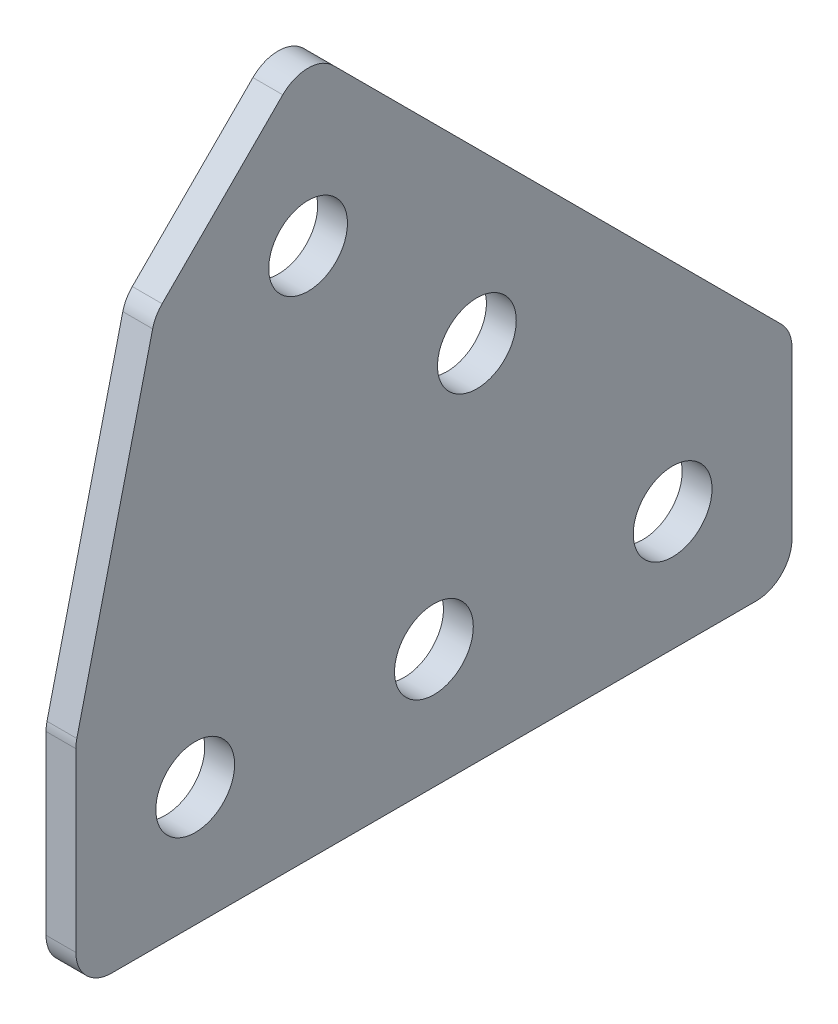
ISO-10303-21;
HEADER;
FILE_DESCRIPTION(('STEP AP214'),'2;1');
FILE_NAME('part.step','',(''),(''),'','','');
FILE_SCHEMA(('AUTOMOTIVE_DESIGN { 1 0 10303 214 1 1 1 1 }'));
ENDSEC;
DATA;
#1=APPLICATION_CONTEXT('core data for automotive mechanical design processes');
#2=APPLICATION_PROTOCOL_DEFINITION('international standard','automotive_design',2000,#1);
#3=PRODUCT_CONTEXT('',#1,'mechanical');
#4=PRODUCT('Part','Part','',(#3));
#5=PRODUCT_RELATED_PRODUCT_CATEGORY('part','',(#4));
#6=PRODUCT_DEFINITION_FORMATION('','',#4);
#7=PRODUCT_DEFINITION_CONTEXT('part definition',#1,'design');
#8=PRODUCT_DEFINITION('design','',#6,#7);
#9=PRODUCT_DEFINITION_SHAPE('','',#8);
#10=(LENGTH_UNIT() NAMED_UNIT(*) SI_UNIT(.MILLI.,.METRE.));
#11=(NAMED_UNIT(*) PLANE_ANGLE_UNIT() SI_UNIT($,.RADIAN.));
#12=(NAMED_UNIT(*) SI_UNIT($,.STERADIAN.) SOLID_ANGLE_UNIT());
#13=UNCERTAINTY_MEASURE_WITH_UNIT(LENGTH_MEASURE(1.E-05),#10,'distance_accuracy_value','');
#14=(GEOMETRIC_REPRESENTATION_CONTEXT(3) GLOBAL_UNCERTAINTY_ASSIGNED_CONTEXT((#13)) GLOBAL_UNIT_ASSIGNED_CONTEXT((#10,
#11,#12)) REPRESENTATION_CONTEXT('',''));
#15=CARTESIAN_POINT('',(0.,0.,0.));
#16=DIRECTION('',(0.,0.,1.));
#17=DIRECTION('',(1.,0.,0.));
#18=AXIS2_PLACEMENT_3D('',#15,#16,#17);
#19=CARTESIAN_POINT('',(2.5,0.,78.1401203778253));
#20=DIRECTION('',(0.,0.,-1.));
#21=DIRECTION('',(-1.,0.,0.));
#22=AXIS2_PLACEMENT_3D('',#19,#20,#21);
#23=PLANE('',#22);
#24=DIRECTION('',(0.,-1.,0.));
#25=VECTOR('',#24,1.);
#26=CARTESIAN_POINT('',(0.,0.,78.1401203778253));
#27=LINE('',#26,#25);
#28=CARTESIAN_POINT('',(0.,17.786290477995,78.1401203778253));
#29=VERTEX_POINT('',#28);
#30=CARTESIAN_POINT('',(0.,3.,78.1401203778253));
#31=VERTEX_POINT('',#30);
#32=EDGE_CURVE('E152',#29,#31,#27,.T.);
#33=ORIENTED_EDGE('',*,*,#32,.T.);
#34=DIRECTION('',(-1.,0.,0.));
#35=VECTOR('',#34,1.);
#36=CARTESIAN_POINT('',(2.5,3.,78.1401203778253));
#37=LINE('',#36,#35);
#38=CARTESIAN_POINT('',(2.5,3.,78.1401203778253));
#39=VERTEX_POINT('',#38);
#40=EDGE_CURVE('E129',#31,#39,#37,.F.);
#41=ORIENTED_EDGE('',*,*,#40,.T.);
#42=DIRECTION('',(0.,-1.,0.));
#43=VECTOR('',#42,1.);
#44=CARTESIAN_POINT('',(2.5,0.,78.1401203778253));
#45=LINE('',#44,#43);
#46=CARTESIAN_POINT('',(2.5,17.786290477995,78.1401203778253));
#47=VERTEX_POINT('',#46);
#48=EDGE_CURVE('E168',#47,#39,#45,.T.);
#49=ORIENTED_EDGE('',*,*,#48,.F.);
#50=DIRECTION('',(-1.,0.,0.));
#51=VECTOR('',#50,1.);
#52=CARTESIAN_POINT('',(2.5,17.786290477995,78.1401203778253));
#53=LINE('',#52,#51);
#54=EDGE_CURVE('E134',#47,#29,#53,.T.);
#55=ORIENTED_EDGE('',*,*,#54,.T.);
#56=EDGE_LOOP('',(#33,#41,#49,#55));
#57=FACE_BOUND('',#56,.T.);
#58=ADVANCED_FACE('F33',(#57),#23,.F.);
#59=CARTESIAN_POINT('',(2.5,0.,78.1401203778253));
#60=DIRECTION('',(0.,1.,0.));
#61=DIRECTION('',(0.,0.,1.));
#62=AXIS2_PLACEMENT_3D('',#59,#60,#61);
#63=PLANE('',#62);
#64=DIRECTION('',(0.,0.,-1.));
#65=VECTOR('',#64,1.);
#66=CARTESIAN_POINT('',(2.5,0.,78.1401203778253));
#67=LINE('',#66,#65);
#68=CARTESIAN_POINT('',(2.5,0.,75.1401203778253));
#69=VERTEX_POINT('',#68);
#70=CARTESIAN_POINT('',(2.5,0.,21.1401203778253));
#71=VERTEX_POINT('',#70);
#72=EDGE_CURVE('E144',#69,#71,#67,.T.);
#73=ORIENTED_EDGE('',*,*,#72,.F.);
#74=DIRECTION('',(-1.,0.,0.));
#75=VECTOR('',#74,1.);
#76=CARTESIAN_POINT('',(2.5,0.,75.1401203778253));
#77=LINE('',#76,#75);
#78=CARTESIAN_POINT('',(0.,0.,75.1401203778253));
#79=VERTEX_POINT('',#78);
#80=EDGE_CURVE('E128',#69,#79,#77,.T.);
#81=ORIENTED_EDGE('',*,*,#80,.T.);
#82=DIRECTION('',(0.,0.,-1.));
#83=VECTOR('',#82,1.);
#84=CARTESIAN_POINT('',(0.,0.,78.1401203778253));
#85=LINE('',#84,#83);
#86=CARTESIAN_POINT('',(0.,0.,21.1401203778253));
#87=VERTEX_POINT('',#86);
#88=EDGE_CURVE('E141',#79,#87,#85,.T.);
#89=ORIENTED_EDGE('',*,*,#88,.T.);
#90=DIRECTION('',(-1.,0.,0.));
#91=VECTOR('',#90,1.);
#92=CARTESIAN_POINT('',(2.5,0.,21.1401203778253));
#93=LINE('',#92,#91);
#94=EDGE_CURVE('E146',#87,#71,#93,.F.);
#95=ORIENTED_EDGE('',*,*,#94,.T.);
#96=EDGE_LOOP('',(#73,#81,#89,#95));
#97=FACE_BOUND('',#96,.T.);
#98=ADVANCED_FACE('F140',(#97),#63,.F.);
#99=CARTESIAN_POINT('',(2.5,0.,18.1401203778253));
#100=DIRECTION('',(0.,0.,1.));
#101=DIRECTION('',(0.,-1.,0.));
#102=AXIS2_PLACEMENT_3D('',#99,#100,#101);
#103=PLANE('',#102);
#104=DIRECTION('',(0.,1.,0.));
#105=VECTOR('',#104,1.);
#106=CARTESIAN_POINT('',(2.5,0.,18.1401203778253));
#107=LINE('',#106,#105);
#108=CARTESIAN_POINT('',(2.5,3.,18.1401203778253));
#109=VERTEX_POINT('',#108);
#110=CARTESIAN_POINT('',(2.5,16.897479690706,18.1401203778253));
#111=VERTEX_POINT('',#110);
#112=EDGE_CURVE('E221',#109,#111,#107,.T.);
#113=ORIENTED_EDGE('',*,*,#112,.F.);
#114=DIRECTION('',(-1.,0.,0.));
#115=VECTOR('',#114,1.);
#116=CARTESIAN_POINT('',(2.5,3.,18.1401203778253));
#117=LINE('',#116,#115);
#118=CARTESIAN_POINT('',(0.,3.,18.1401203778253));
#119=VERTEX_POINT('',#118);
#120=EDGE_CURVE('E203',#109,#119,#117,.T.);
#121=ORIENTED_EDGE('',*,*,#120,.T.);
#122=DIRECTION('',(0.,1.,0.));
#123=VECTOR('',#122,1.);
#124=CARTESIAN_POINT('',(0.,0.,18.1401203778253));
#125=LINE('',#124,#123);
#126=CARTESIAN_POINT('',(0.,16.897479690706,18.1401203778253));
#127=VERTEX_POINT('',#126);
#128=EDGE_CURVE('E151',#119,#127,#125,.T.);
#129=ORIENTED_EDGE('',*,*,#128,.T.);
#130=DIRECTION('',(-1.,0.,0.));
#131=VECTOR('',#130,1.);
#132=CARTESIAN_POINT('',(2.5,16.897479690706,18.1401203778253));
#133=LINE('',#132,#131);
#134=EDGE_CURVE('E201',#127,#111,#133,.F.);
#135=ORIENTED_EDGE('',*,*,#134,.T.);
#136=EDGE_LOOP('',(#113,#121,#129,#135));
#137=FACE_BOUND('',#136,.T.);
#138=ADVANCED_FACE('F309',(#137),#103,.F.);
#139=CARTESIAN_POINT('',(2.5,18.1401203778253,18.1401203778253));
#140=DIRECTION('',(0.,-0.707106781186548,0.707106781186548));
#141=DIRECTION('',(0.,-0.707106781186548,-0.707106781186548));
#142=AXIS2_PLACEMENT_3D('',#139,#140,#141);
#143=PLANE('',#142);
#144=DIRECTION('',(0.,0.707106781186548,0.707106781186548));
#145=VECTOR('',#144,1.);
#146=CARTESIAN_POINT('',(2.5,18.1401203778253,18.1401203778253));
#147=LINE('',#146,#145);
#148=CARTESIAN_POINT('',(2.5,19.0188000342656,19.0188000342656));
#149=VERTEX_POINT('',#148);
#150=CARTESIAN_POINT('',(2.5,56.5617492764832,56.5617492764832));
#151=VERTEX_POINT('',#150);
#152=EDGE_CURVE('E210',#149,#151,#147,.T.);
#153=ORIENTED_EDGE('',*,*,#152,.F.);
#154=DIRECTION('',(-1.,0.,0.));
#155=VECTOR('',#154,1.);
#156=CARTESIAN_POINT('',(2.5,19.0188000342656,19.0188000342656));
#157=LINE('',#156,#155);
#158=CARTESIAN_POINT('',(0.,19.0188000342656,19.0188000342656));
#159=VERTEX_POINT('',#158);
#160=EDGE_CURVE('E11',#149,#159,#157,.T.);
#161=ORIENTED_EDGE('',*,*,#160,.T.);
#162=DIRECTION('',(0.,0.707106781186548,0.707106781186548));
#163=VECTOR('',#162,1.);
#164=CARTESIAN_POINT('',(0.,18.1401203778253,18.1401203778253));
#165=LINE('',#164,#163);
#166=CARTESIAN_POINT('',(0.,56.5617492764832,56.5617492764832));
#167=VERTEX_POINT('',#166);
#168=EDGE_CURVE('E155',#159,#167,#165,.T.);
#169=ORIENTED_EDGE('',*,*,#168,.T.);
#170=DIRECTION('',(-1.,0.,0.));
#171=VECTOR('',#170,1.);
#172=CARTESIAN_POINT('',(2.5,56.5617492764832,56.5617492764832));
#173=LINE('',#172,#171);
#174=EDGE_CURVE('E41',#167,#151,#173,.F.);
#175=ORIENTED_EDGE('',*,*,#174,.T.);
#176=EDGE_LOOP('',(#153,#161,#169,#175));
#177=FACE_BOUND('',#176,.T.);
#178=ADVANCED_FACE('F209',(#177),#143,.F.);
#179=CARTESIAN_POINT('',(2.5,58.6830696200429,58.6830696200429));
#180=DIRECTION('',(0.,-0.707106781186547,-0.707106781186548));
#181=DIRECTION('',(0.,0.707106781186548,-0.707106781186547));
#182=AXIS2_PLACEMENT_3D('',#179,#180,#181);
#183=PLANE('',#182);
#184=DIRECTION('',(0.,-0.707106781186548,0.707106781186547));
#185=VECTOR('',#184,1.);
#186=CARTESIAN_POINT('',(0.,58.6830696200429,58.6830696200429));
#187=LINE('',#186,#185);
#188=CARTESIAN_POINT('',(0.,56.5617492764832,60.8043899636025));
#189=VERTEX_POINT('',#188);
#190=CARTESIAN_POINT('',(0.,46.4552779666841,70.9108612734016));
#191=VERTEX_POINT('',#190);
#192=EDGE_CURVE('E163',#189,#191,#187,.T.);
#193=ORIENTED_EDGE('',*,*,#192,.T.);
#194=DIRECTION('',(-1.,0.,0.));
#195=VECTOR('',#194,1.);
#196=CARTESIAN_POINT('',(2.5,46.4552779666841,70.9108612734016));
#197=LINE('',#196,#195);
#198=CARTESIAN_POINT('',(2.5,46.4552779666841,70.9108612734016));
#199=VERTEX_POINT('',#198);
#200=EDGE_CURVE('E199',#191,#199,#197,.F.);
#201=ORIENTED_EDGE('',*,*,#200,.T.);
#202=DIRECTION('',(0.,-0.707106781186548,0.707106781186547));
#203=VECTOR('',#202,1.);
#204=CARTESIAN_POINT('',(2.5,58.6830696200429,58.6830696200429));
#205=LINE('',#204,#203);
#206=CARTESIAN_POINT('',(2.5,56.5617492764832,60.8043899636025));
#207=VERTEX_POINT('',#206);
#208=EDGE_CURVE('E220',#207,#199,#205,.T.);
#209=ORIENTED_EDGE('',*,*,#208,.F.);
#210=DIRECTION('',(-1.,0.,0.));
#211=VECTOR('',#210,1.);
#212=CARTESIAN_POINT('',(2.5,56.5617492764832,60.8043899636025));
#213=LINE('',#212,#211);
#214=EDGE_CURVE('E196',#207,#189,#213,.T.);
#215=ORIENTED_EDGE('',*,*,#214,.T.);
#216=EDGE_LOOP('',(#193,#201,#209,#215));
#217=FACE_BOUND('',#216,.T.);
#218=ADVANCED_FACE('F226',(#217),#183,.F.);
#219=CARTESIAN_POINT('',(2.5,18.1401203778253,78.1401203778253));
#220=DIRECTION('',(0.,-0.232650289648966,-0.972560457106011));
#221=DIRECTION('',(0.,0.972560457106011,-0.232650289648966));
#222=AXIS2_PLACEMENT_3D('',#219,#220,#221);
#223=PLANE('',#222);
#224=DIRECTION('',(0.,-0.97256045710601,0.232650289648966));
#225=VECTOR('',#224,1.);
#226=CARTESIAN_POINT('',(0.,18.1401203778253,78.1401203778253));
#227=LINE('',#226,#225);
#228=CARTESIAN_POINT('',(0.,45.0319084920713,71.70722230116));
#229=VERTEX_POINT('',#228);
#230=CARTESIAN_POINT('',(0.,18.4842413469419,78.0578017491433));
#231=VERTEX_POINT('',#230);
#232=EDGE_CURVE('E166',#229,#231,#227,.T.);
#233=ORIENTED_EDGE('',*,*,#232,.T.);
#234=DIRECTION('',(-1.,0.,0.));
#235=VECTOR('',#234,1.);
#236=CARTESIAN_POINT('',(2.5,18.4842413469419,78.0578017491433));
#237=LINE('',#236,#235);
#238=CARTESIAN_POINT('',(2.5,18.4842413469419,78.0578017491433));
#239=VERTEX_POINT('',#238);
#240=EDGE_CURVE('E48',#231,#239,#237,.F.);
#241=ORIENTED_EDGE('',*,*,#240,.T.);
#242=DIRECTION('',(0.,-0.97256045710601,0.232650289648966));
#243=VECTOR('',#242,1.);
#244=CARTESIAN_POINT('',(2.5,18.1401203778253,78.1401203778253));
#245=LINE('',#244,#243);
#246=CARTESIAN_POINT('',(2.5,45.0319084920713,71.70722230116));
#247=VERTEX_POINT('',#246);
#248=EDGE_CURVE('E169',#247,#239,#245,.T.);
#249=ORIENTED_EDGE('',*,*,#248,.F.);
#250=DIRECTION('',(-1.,0.,0.));
#251=VECTOR('',#250,1.);
#252=CARTESIAN_POINT('',(2.5,45.0319084920713,71.70722230116));
#253=LINE('',#252,#251);
#254=EDGE_CURVE('E192',#247,#229,#253,.T.);
#255=ORIENTED_EDGE('',*,*,#254,.T.);
#256=EDGE_LOOP('',(#233,#241,#249,#255));
#257=FACE_BOUND('',#256,.T.);
#258=ADVANCED_FACE('F232',(#257),#223,.F.);
#259=CARTESIAN_POINT('',(2.5,0.,0.));
#260=DIRECTION('',(-1.,0.,0.));
#261=DIRECTION('',(0.,0.,1.));
#262=AXIS2_PLACEMENT_3D('',#259,#260,#261);
#263=PLANE('',#262);
#264=CARTESIAN_POINT('',(2.5,30.398798372581,44.5409339963119));
#265=DIRECTION('',(1.,0.,0.));
#266=DIRECTION('',(0.,0.,-1.));
#267=AXIS2_PLACEMENT_3D('',#264,#265,#266);
#268=CIRCLE('',#267,3.3);
#269=CARTESIAN_POINT('',(2.5,30.398798372581,41.2409339963119));
#270=VERTEX_POINT('',#269);
#271=EDGE_CURVE('E263',#270,#270,#268,.T.);
#272=ORIENTED_EDGE('',*,*,#271,.F.);
#273=EDGE_LOOP('',(#272));
#274=FACE_BOUND('',#273,.T.);
#275=CARTESIAN_POINT('',(2.5,44.5409339963119,58.6830696200429));
#276=DIRECTION('',(1.,0.,0.));
#277=DIRECTION('',(0.,0.,-1.));
#278=AXIS2_PLACEMENT_3D('',#275,#276,#277);
#279=CIRCLE('',#278,3.3);
#280=CARTESIAN_POINT('',(2.5,44.5409339963119,55.3830696200429));
#281=VERTEX_POINT('',#280);
#282=EDGE_CURVE('E257',#281,#281,#279,.T.);
#283=ORIENTED_EDGE('',*,*,#282,.F.);
#284=EDGE_LOOP('',(#283));
#285=FACE_BOUND('',#284,.T.);
#286=CARTESIAN_POINT('',(2.5,10.,68.1401203778253));
#287=DIRECTION('',(1.,0.,0.));
#288=DIRECTION('',(0.,0.,-1.));
#289=AXIS2_PLACEMENT_3D('',#286,#287,#288);
#290=CIRCLE('',#289,3.3);
#291=CARTESIAN_POINT('',(2.5,10.,64.8401203778253));
#292=VERTEX_POINT('',#291);
#293=EDGE_CURVE('E251',#292,#292,#290,.T.);
#294=ORIENTED_EDGE('',*,*,#293,.F.);
#295=EDGE_LOOP('',(#294));
#296=FACE_BOUND('',#295,.T.);
#297=CARTESIAN_POINT('',(2.5,10.,48.1401203778253));
#298=DIRECTION('',(1.,0.,0.));
#299=DIRECTION('',(0.,0.,-1.));
#300=AXIS2_PLACEMENT_3D('',#297,#298,#299);
#301=CIRCLE('',#300,3.3);
#302=CARTESIAN_POINT('',(2.5,10.,44.8401203778253));
#303=VERTEX_POINT('',#302);
#304=EDGE_CURVE('E245',#303,#303,#301,.T.);
#305=ORIENTED_EDGE('',*,*,#304,.F.);
#306=EDGE_LOOP('',(#305));
#307=FACE_BOUND('',#306,.T.);
#308=CARTESIAN_POINT('',(2.5,10.,28.1401203778253));
#309=DIRECTION('',(1.,0.,0.));
#310=DIRECTION('',(0.,0.,-1.));
#311=AXIS2_PLACEMENT_3D('',#308,#309,#310);
#312=CIRCLE('',#311,3.3);
#313=CARTESIAN_POINT('',(2.5,10.,24.8401203778253));
#314=VERTEX_POINT('',#313);
#315=EDGE_CURVE('E239',#314,#314,#312,.T.);
#316=ORIENTED_EDGE('',*,*,#315,.F.);
#317=EDGE_LOOP('',(#316));
#318=FACE_BOUND('',#317,.T.);
#319=ORIENTED_EDGE('',*,*,#48,.T.);
#320=CARTESIAN_POINT('',(2.5,3.,75.1401203778253));
#321=DIRECTION('',(-1.,0.,0.));
#322=DIRECTION('',(0.,0.,1.));
#323=AXIS2_PLACEMENT_3D('',#320,#321,#322);
#324=CIRCLE('',#323,3.);
#325=EDGE_CURVE('E190',#39,#69,#324,.F.);
#326=ORIENTED_EDGE('',*,*,#325,.T.);
#327=ORIENTED_EDGE('',*,*,#72,.T.);
#328=CARTESIAN_POINT('',(2.5,3.,21.1401203778253));
#329=DIRECTION('',(-1.,0.,0.));
#330=DIRECTION('',(0.,0.,1.));
#331=AXIS2_PLACEMENT_3D('',#328,#329,#330);
#332=CIRCLE('',#331,3.);
#333=EDGE_CURVE('E185',#71,#109,#332,.F.);
#334=ORIENTED_EDGE('',*,*,#333,.T.);
#335=ORIENTED_EDGE('',*,*,#112,.T.);
#336=CARTESIAN_POINT('',(2.5,16.897479690706,21.1401203778253));
#337=DIRECTION('',(-1.,0.,0.));
#338=DIRECTION('',(0.,0.,1.));
#339=AXIS2_PLACEMENT_3D('',#336,#337,#338);
#340=CIRCLE('',#339,3.);
#341=EDGE_CURVE('E183',#111,#149,#340,.F.);
#342=ORIENTED_EDGE('',*,*,#341,.T.);
#343=ORIENTED_EDGE('',*,*,#152,.T.);
#344=CARTESIAN_POINT('',(2.5,54.4404289329236,58.6830696200429));
#345=DIRECTION('',(-1.,0.,0.));
#346=DIRECTION('',(0.,0.,1.));
#347=AXIS2_PLACEMENT_3D('',#344,#345,#346);
#348=CIRCLE('',#347,3.);
#349=EDGE_CURVE('E181',#151,#207,#348,.F.);
#350=ORIENTED_EDGE('',*,*,#349,.T.);
#351=ORIENTED_EDGE('',*,*,#208,.T.);
#352=CARTESIAN_POINT('',(2.5,44.3339576231244,68.789540929842));
#353=DIRECTION('',(-1.,0.,0.));
#354=DIRECTION('',(0.,0.,1.));
#355=AXIS2_PLACEMENT_3D('',#352,#353,#354);
#356=CIRCLE('',#355,3.);
#357=EDGE_CURVE('E55',#199,#247,#356,.F.);
#358=ORIENTED_EDGE('',*,*,#357,.T.);
#359=ORIENTED_EDGE('',*,*,#248,.T.);
#360=CARTESIAN_POINT('',(2.5,17.786290477995,75.1401203778253));
#361=DIRECTION('',(-1.,0.,0.));
#362=DIRECTION('',(0.,0.,1.));
#363=AXIS2_PLACEMENT_3D('',#360,#361,#362);
#364=CIRCLE('',#363,3.);
#365=EDGE_CURVE('E188',#239,#47,#364,.F.);
#366=ORIENTED_EDGE('',*,*,#365,.T.);
#367=EDGE_LOOP('',(#319,#326,#327,#334,#335,#342,#343,#350,#351,#358,#359,#366));
#368=FACE_BOUND('',#367,.T.);
#369=ADVANCED_FACE('F216',(#274,#285,#296,#307,#318,#368),#263,.F.);
#370=CARTESIAN_POINT('',(0.,0.,0.));
#371=DIRECTION('',(-1.,0.,0.));
#372=DIRECTION('',(0.,0.,1.));
#373=AXIS2_PLACEMENT_3D('',#370,#371,#372);
#374=PLANE('',#373);
#375=CARTESIAN_POINT('',(0.,30.398798372581,44.5409339963119));
#376=DIRECTION('',(1.,0.,0.));
#377=DIRECTION('',(0.,0.,-1.));
#378=AXIS2_PLACEMENT_3D('',#375,#376,#377);
#379=CIRCLE('',#378,3.3);
#380=CARTESIAN_POINT('',(0.,30.398798372581,41.2409339963119));
#381=VERTEX_POINT('',#380);
#382=EDGE_CURVE('E260',#381,#381,#379,.T.);
#383=ORIENTED_EDGE('',*,*,#382,.T.);
#384=EDGE_LOOP('',(#383));
#385=FACE_BOUND('',#384,.T.);
#386=CARTESIAN_POINT('',(0.,44.5409339963119,58.6830696200429));
#387=DIRECTION('',(1.,0.,0.));
#388=DIRECTION('',(0.,0.,-1.));
#389=AXIS2_PLACEMENT_3D('',#386,#387,#388);
#390=CIRCLE('',#389,3.3);
#391=CARTESIAN_POINT('',(0.,44.5409339963119,55.3830696200429));
#392=VERTEX_POINT('',#391);
#393=EDGE_CURVE('E254',#392,#392,#390,.T.);
#394=ORIENTED_EDGE('',*,*,#393,.T.);
#395=EDGE_LOOP('',(#394));
#396=FACE_BOUND('',#395,.T.);
#397=CARTESIAN_POINT('',(0.,10.,68.1401203778253));
#398=DIRECTION('',(1.,0.,0.));
#399=DIRECTION('',(0.,0.,-1.));
#400=AXIS2_PLACEMENT_3D('',#397,#398,#399);
#401=CIRCLE('',#400,3.3);
#402=CARTESIAN_POINT('',(0.,10.,64.8401203778253));
#403=VERTEX_POINT('',#402);
#404=EDGE_CURVE('E248',#403,#403,#401,.T.);
#405=ORIENTED_EDGE('',*,*,#404,.T.);
#406=EDGE_LOOP('',(#405));
#407=FACE_BOUND('',#406,.T.);
#408=CARTESIAN_POINT('',(0.,10.,48.1401203778253));
#409=DIRECTION('',(1.,0.,0.));
#410=DIRECTION('',(0.,0.,-1.));
#411=AXIS2_PLACEMENT_3D('',#408,#409,#410);
#412=CIRCLE('',#411,3.3);
#413=CARTESIAN_POINT('',(0.,10.,44.8401203778253));
#414=VERTEX_POINT('',#413);
#415=EDGE_CURVE('E242',#414,#414,#412,.T.);
#416=ORIENTED_EDGE('',*,*,#415,.T.);
#417=EDGE_LOOP('',(#416));
#418=FACE_BOUND('',#417,.T.);
#419=CARTESIAN_POINT('',(0.,10.,28.1401203778253));
#420=DIRECTION('',(1.,0.,0.));
#421=DIRECTION('',(0.,0.,-1.));
#422=AXIS2_PLACEMENT_3D('',#419,#420,#421);
#423=CIRCLE('',#422,3.3);
#424=CARTESIAN_POINT('',(0.,10.,24.8401203778253));
#425=VERTEX_POINT('',#424);
#426=EDGE_CURVE('E157',#425,#425,#423,.T.);
#427=ORIENTED_EDGE('',*,*,#426,.T.);
#428=EDGE_LOOP('',(#427));
#429=FACE_BOUND('',#428,.T.);
#430=ORIENTED_EDGE('',*,*,#88,.F.);
#431=CARTESIAN_POINT('',(0.,3.,75.1401203778253));
#432=DIRECTION('',(-1.,0.,0.));
#433=DIRECTION('',(0.,0.,1.));
#434=AXIS2_PLACEMENT_3D('',#431,#432,#433);
#435=CIRCLE('',#434,3.);
#436=EDGE_CURVE('E124',#79,#31,#435,.T.);
#437=ORIENTED_EDGE('',*,*,#436,.T.);
#438=ORIENTED_EDGE('',*,*,#32,.F.);
#439=CARTESIAN_POINT('',(0.,17.786290477995,75.1401203778253));
#440=DIRECTION('',(-1.,0.,0.));
#441=DIRECTION('',(0.,0.,1.));
#442=AXIS2_PLACEMENT_3D('',#439,#440,#441);
#443=CIRCLE('',#442,3.);
#444=EDGE_CURVE('E135',#29,#231,#443,.T.);
#445=ORIENTED_EDGE('',*,*,#444,.T.);
#446=ORIENTED_EDGE('',*,*,#232,.F.);
#447=CARTESIAN_POINT('',(0.,44.3339576231244,68.789540929842));
#448=DIRECTION('',(-1.,0.,0.));
#449=DIRECTION('',(0.,0.,1.));
#450=AXIS2_PLACEMENT_3D('',#447,#448,#449);
#451=CIRCLE('',#450,3.);
#452=EDGE_CURVE('E175',#229,#191,#451,.T.);
#453=ORIENTED_EDGE('',*,*,#452,.T.);
#454=ORIENTED_EDGE('',*,*,#192,.F.);
#455=CARTESIAN_POINT('',(0.,54.4404289329236,58.6830696200429));
#456=DIRECTION('',(-1.,0.,0.));
#457=DIRECTION('',(0.,0.,1.));
#458=AXIS2_PLACEMENT_3D('',#455,#456,#457);
#459=CIRCLE('',#458,3.);
#460=EDGE_CURVE('E145',#189,#167,#459,.T.);
#461=ORIENTED_EDGE('',*,*,#460,.T.);
#462=ORIENTED_EDGE('',*,*,#168,.F.);
#463=CARTESIAN_POINT('',(0.,16.897479690706,21.1401203778253));
#464=DIRECTION('',(-1.,0.,0.));
#465=DIRECTION('',(0.,0.,1.));
#466=AXIS2_PLACEMENT_3D('',#463,#464,#465);
#467=CIRCLE('',#466,3.);
#468=EDGE_CURVE('E172',#159,#127,#467,.T.);
#469=ORIENTED_EDGE('',*,*,#468,.T.);
#470=ORIENTED_EDGE('',*,*,#128,.F.);
#471=CARTESIAN_POINT('',(0.,3.,21.1401203778253));
#472=DIRECTION('',(-1.,0.,0.));
#473=DIRECTION('',(0.,0.,1.));
#474=AXIS2_PLACEMENT_3D('',#471,#472,#473);
#475=CIRCLE('',#474,3.);
#476=EDGE_CURVE('E150',#119,#87,#475,.T.);
#477=ORIENTED_EDGE('',*,*,#476,.T.);
#478=EDGE_LOOP('',(#430,#437,#438,#445,#446,#453,#454,#461,#462,#469,#470,#477));
#479=FACE_BOUND('',#478,.T.);
#480=ADVANCED_FACE('F148',(#385,#396,#407,#418,#429,#479),#374,.T.);
#481=CARTESIAN_POINT('',(0.,10.,28.1401203778253));
#482=DIRECTION('',(1.,0.,0.));
#483=DIRECTION('',(0.,0.,-1.));
#484=AXIS2_PLACEMENT_3D('',#481,#482,#483);
#485=CYLINDRICAL_SURFACE('',#484,3.3);
#486=ORIENTED_EDGE('',*,*,#426,.F.);
#487=EDGE_LOOP('',(#486));
#488=FACE_BOUND('',#487,.T.);
#489=ORIENTED_EDGE('',*,*,#315,.T.);
#490=EDGE_LOOP('',(#489));
#491=FACE_BOUND('',#490,.T.);
#492=ADVANCED_FACE('F289',(#488,#491),#485,.F.);
#493=CARTESIAN_POINT('',(0.,10.,48.1401203778253));
#494=DIRECTION('',(1.,0.,0.));
#495=DIRECTION('',(0.,0.,-1.));
#496=AXIS2_PLACEMENT_3D('',#493,#494,#495);
#497=CYLINDRICAL_SURFACE('',#496,3.3);
#498=ORIENTED_EDGE('',*,*,#415,.F.);
#499=EDGE_LOOP('',(#498));
#500=FACE_BOUND('',#499,.T.);
#501=ORIENTED_EDGE('',*,*,#304,.T.);
#502=EDGE_LOOP('',(#501));
#503=FACE_BOUND('',#502,.T.);
#504=ADVANCED_FACE('F291',(#500,#503),#497,.F.);
#505=CARTESIAN_POINT('',(0.,10.,68.1401203778253));
#506=DIRECTION('',(1.,0.,0.));
#507=DIRECTION('',(0.,0.,-1.));
#508=AXIS2_PLACEMENT_3D('',#505,#506,#507);
#509=CYLINDRICAL_SURFACE('',#508,3.3);
#510=ORIENTED_EDGE('',*,*,#404,.F.);
#511=EDGE_LOOP('',(#510));
#512=FACE_BOUND('',#511,.T.);
#513=ORIENTED_EDGE('',*,*,#293,.T.);
#514=EDGE_LOOP('',(#513));
#515=FACE_BOUND('',#514,.T.);
#516=ADVANCED_FACE('F298',(#512,#515),#509,.F.);
#517=CARTESIAN_POINT('',(0.,44.5409339963119,58.6830696200429));
#518=DIRECTION('',(1.,0.,0.));
#519=DIRECTION('',(0.,0.,-1.));
#520=AXIS2_PLACEMENT_3D('',#517,#518,#519);
#521=CYLINDRICAL_SURFACE('',#520,3.3);
#522=ORIENTED_EDGE('',*,*,#393,.F.);
#523=EDGE_LOOP('',(#522));
#524=FACE_BOUND('',#523,.T.);
#525=ORIENTED_EDGE('',*,*,#282,.T.);
#526=EDGE_LOOP('',(#525));
#527=FACE_BOUND('',#526,.T.);
#528=ADVANCED_FACE('F274',(#524,#527),#521,.F.);
#529=CARTESIAN_POINT('',(0.,30.398798372581,44.5409339963119));
#530=DIRECTION('',(1.,0.,0.));
#531=DIRECTION('',(0.,0.,-1.));
#532=AXIS2_PLACEMENT_3D('',#529,#530,#531);
#533=CYLINDRICAL_SURFACE('',#532,3.3);
#534=ORIENTED_EDGE('',*,*,#382,.F.);
#535=EDGE_LOOP('',(#534));
#536=FACE_BOUND('',#535,.T.);
#537=ORIENTED_EDGE('',*,*,#271,.T.);
#538=EDGE_LOOP('',(#537));
#539=FACE_BOUND('',#538,.T.);
#540=ADVANCED_FACE('F271',(#536,#539),#533,.F.);
#541=CARTESIAN_POINT('',(2.5,3.,75.1401203778253));
#542=DIRECTION('',(-1.,0.,0.));
#543=DIRECTION('',(0.,0.,1.));
#544=AXIS2_PLACEMENT_3D('',#541,#542,#543);
#545=CYLINDRICAL_SURFACE('',#544,3.);
#546=ORIENTED_EDGE('',*,*,#325,.F.);
#547=ORIENTED_EDGE('',*,*,#40,.F.);
#548=ORIENTED_EDGE('',*,*,#436,.F.);
#549=ORIENTED_EDGE('',*,*,#80,.F.);
#550=EDGE_LOOP('',(#546,#547,#548,#549));
#551=FACE_BOUND('',#550,.T.);
#552=ADVANCED_FACE('F127',(#551),#545,.T.);
#553=CARTESIAN_POINT('',(2.5,17.786290477995,75.1401203778253));
#554=DIRECTION('',(-1.,0.,0.));
#555=DIRECTION('',(0.,0.,1.));
#556=AXIS2_PLACEMENT_3D('',#553,#554,#555);
#557=CYLINDRICAL_SURFACE('',#556,3.);
#558=ORIENTED_EDGE('',*,*,#365,.F.);
#559=ORIENTED_EDGE('',*,*,#240,.F.);
#560=ORIENTED_EDGE('',*,*,#444,.F.);
#561=ORIENTED_EDGE('',*,*,#54,.F.);
#562=EDGE_LOOP('',(#558,#559,#560,#561));
#563=FACE_BOUND('',#562,.T.);
#564=ADVANCED_FACE('F315',(#563),#557,.T.);
#565=CARTESIAN_POINT('',(2.5,44.3339576231244,68.789540929842));
#566=DIRECTION('',(-1.,0.,0.));
#567=DIRECTION('',(0.,0.,1.));
#568=AXIS2_PLACEMENT_3D('',#565,#566,#567);
#569=CYLINDRICAL_SURFACE('',#568,3.);
#570=ORIENTED_EDGE('',*,*,#357,.F.);
#571=ORIENTED_EDGE('',*,*,#200,.F.);
#572=ORIENTED_EDGE('',*,*,#452,.F.);
#573=ORIENTED_EDGE('',*,*,#254,.F.);
#574=EDGE_LOOP('',(#570,#571,#572,#573));
#575=FACE_BOUND('',#574,.T.);
#576=ADVANCED_FACE('F231',(#575),#569,.T.);
#577=CARTESIAN_POINT('',(2.5,3.,21.1401203778253));
#578=DIRECTION('',(-1.,0.,0.));
#579=DIRECTION('',(0.,0.,1.));
#580=AXIS2_PLACEMENT_3D('',#577,#578,#579);
#581=CYLINDRICAL_SURFACE('',#580,3.);
#582=ORIENTED_EDGE('',*,*,#333,.F.);
#583=ORIENTED_EDGE('',*,*,#94,.F.);
#584=ORIENTED_EDGE('',*,*,#476,.F.);
#585=ORIENTED_EDGE('',*,*,#120,.F.);
#586=EDGE_LOOP('',(#582,#583,#584,#585));
#587=FACE_BOUND('',#586,.T.);
#588=ADVANCED_FACE('F321',(#587),#581,.T.);
#589=CARTESIAN_POINT('',(2.5,16.897479690706,21.1401203778253));
#590=DIRECTION('',(-1.,0.,0.));
#591=DIRECTION('',(0.,0.,1.));
#592=AXIS2_PLACEMENT_3D('',#589,#590,#591);
#593=CYLINDRICAL_SURFACE('',#592,3.);
#594=ORIENTED_EDGE('',*,*,#341,.F.);
#595=ORIENTED_EDGE('',*,*,#134,.F.);
#596=ORIENTED_EDGE('',*,*,#468,.F.);
#597=ORIENTED_EDGE('',*,*,#160,.F.);
#598=EDGE_LOOP('',(#594,#595,#596,#597));
#599=FACE_BOUND('',#598,.T.);
#600=ADVANCED_FACE('F323',(#599),#593,.T.);
#601=CARTESIAN_POINT('',(2.5,54.4404289329236,58.6830696200429));
#602=DIRECTION('',(-1.,0.,0.));
#603=DIRECTION('',(0.,0.,1.));
#604=AXIS2_PLACEMENT_3D('',#601,#602,#603);
#605=CYLINDRICAL_SURFACE('',#604,3.);
#606=ORIENTED_EDGE('',*,*,#349,.F.);
#607=ORIENTED_EDGE('',*,*,#174,.F.);
#608=ORIENTED_EDGE('',*,*,#460,.F.);
#609=ORIENTED_EDGE('',*,*,#214,.F.);
#610=EDGE_LOOP('',(#606,#607,#608,#609));
#611=FACE_BOUND('',#610,.T.);
#612=ADVANCED_FACE('F35',(#611),#605,.T.);
#613=CLOSED_SHELL('',(#58,#98,#138,#178,#218,#258,#369,#480,#492,#504,#516,#528,#540,#552,#564,
#576,#588,#600,#612));
#614=MANIFOLD_SOLID_BREP('B2',#613);
#615=ADVANCED_BREP_SHAPE_REPRESENTATION('',(#18,#614),#14);
#616=SHAPE_DEFINITION_REPRESENTATION(#9,#615);
ENDSEC;
END-ISO-10303-21;
